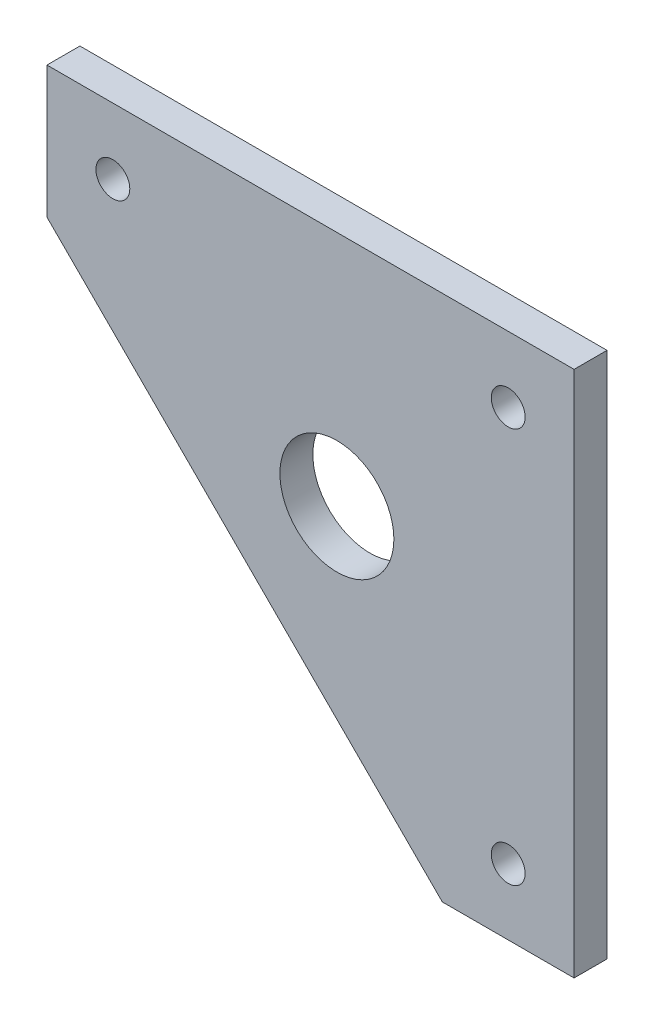
ISO-10303-21;
HEADER;
FILE_DESCRIPTION(('STEP AP214'),'2;1');
FILE_NAME('part.step','',(''),(''),'','','');
FILE_SCHEMA(('AUTOMOTIVE_DESIGN { 1 0 10303 214 1 1 1 1 }'));
ENDSEC;
DATA;
#1=APPLICATION_CONTEXT('core data for automotive mechanical design processes');
#2=APPLICATION_PROTOCOL_DEFINITION('international standard','automotive_design',2000,#1);
#3=PRODUCT_CONTEXT('',#1,'mechanical');
#4=PRODUCT('Part','Part','',(#3));
#5=PRODUCT_RELATED_PRODUCT_CATEGORY('part','',(#4));
#6=PRODUCT_DEFINITION_FORMATION('','',#4);
#7=PRODUCT_DEFINITION_CONTEXT('part definition',#1,'design');
#8=PRODUCT_DEFINITION('design','',#6,#7);
#9=PRODUCT_DEFINITION_SHAPE('','',#8);
#10=(LENGTH_UNIT() NAMED_UNIT(*) SI_UNIT(.MILLI.,.METRE.));
#11=(NAMED_UNIT(*) PLANE_ANGLE_UNIT() SI_UNIT($,.RADIAN.));
#12=(NAMED_UNIT(*) SI_UNIT($,.STERADIAN.) SOLID_ANGLE_UNIT());
#13=UNCERTAINTY_MEASURE_WITH_UNIT(LENGTH_MEASURE(1.E-05),#10,'distance_accuracy_value','');
#14=(GEOMETRIC_REPRESENTATION_CONTEXT(3) GLOBAL_UNCERTAINTY_ASSIGNED_CONTEXT((#13)) GLOBAL_UNIT_ASSIGNED_CONTEXT((#10,
#11,#12)) REPRESENTATION_CONTEXT('',''));
#15=CARTESIAN_POINT('',(0.,0.,0.));
#16=DIRECTION('',(0.,0.,1.));
#17=DIRECTION('',(1.,0.,0.));
#18=AXIS2_PLACEMENT_3D('',#15,#16,#17);
#19=CARTESIAN_POINT('',(0.,0.,6.35));
#20=DIRECTION('',(0.,0.,1.));
#21=DIRECTION('',(1.,0.,0.));
#22=AXIS2_PLACEMENT_3D('',#19,#20,#21);
#23=PLANE('',#22);
#24=CARTESIAN_POINT('',(0.,0.,6.35));
#25=DIRECTION('',(0.,0.,1.));
#26=DIRECTION('',(1.,0.,0.));
#27=AXIS2_PLACEMENT_3D('',#24,#25,#26);
#28=CIRCLE('',#27,3.26389999999999);
#29=CARTESIAN_POINT('',(3.26389999999999,0.,6.35));
#30=VERTEX_POINT('',#29);
#31=EDGE_CURVE('E166',#30,#30,#28,.T.);
#32=ORIENTED_EDGE('',*,*,#31,.F.);
#33=EDGE_LOOP('',(#32));
#34=FACE_BOUND('',#33,.T.);
#35=CARTESIAN_POINT('',(-76.2,0.,6.35));
#36=DIRECTION('',(0.,0.,1.));
#37=DIRECTION('',(1.,0.,0.));
#38=AXIS2_PLACEMENT_3D('',#35,#36,#37);
#39=CIRCLE('',#38,3.26389999999999);
#40=CARTESIAN_POINT('',(-72.9361,0.,6.35));
#41=VERTEX_POINT('',#40);
#42=EDGE_CURVE('E168',#41,#41,#39,.T.);
#43=ORIENTED_EDGE('',*,*,#42,.F.);
#44=EDGE_LOOP('',(#43));
#45=FACE_BOUND('',#44,.T.);
#46=CARTESIAN_POINT('',(0.,-76.2,6.35));
#47=DIRECTION('',(0.,0.,1.));
#48=DIRECTION('',(1.,0.,0.));
#49=AXIS2_PLACEMENT_3D('',#46,#47,#48);
#50=CIRCLE('',#49,3.26389999999999);
#51=CARTESIAN_POINT('',(3.26389999999999,-76.2,6.35));
#52=VERTEX_POINT('',#51);
#53=EDGE_CURVE('E176',#52,#52,#50,.T.);
#54=ORIENTED_EDGE('',*,*,#53,.F.);
#55=EDGE_LOOP('',(#54));
#56=FACE_BOUND('',#55,.T.);
#57=DIRECTION('',(0.,1.,0.));
#58=VECTOR('',#57,1.);
#59=CARTESIAN_POINT('',(12.7,12.7,6.35));
#60=LINE('',#59,#58);
#61=CARTESIAN_POINT('',(12.7,-88.9,6.35));
#62=VERTEX_POINT('',#61);
#63=CARTESIAN_POINT('',(12.7,12.7,6.35));
#64=VERTEX_POINT('',#63);
#65=EDGE_CURVE('E117',#62,#64,#60,.T.);
#66=ORIENTED_EDGE('',*,*,#65,.T.);
#67=DIRECTION('',(-1.,0.,0.));
#68=VECTOR('',#67,1.);
#69=CARTESIAN_POINT('',(-88.9,12.7,6.35));
#70=LINE('',#69,#68);
#71=CARTESIAN_POINT('',(-88.9,12.7,6.35));
#72=VERTEX_POINT('',#71);
#73=EDGE_CURVE('E84',#64,#72,#70,.T.);
#74=ORIENTED_EDGE('',*,*,#73,.T.);
#75=DIRECTION('',(0.,-1.,0.));
#76=VECTOR('',#75,1.);
#77=CARTESIAN_POINT('',(-88.9,12.7,6.35));
#78=LINE('',#77,#76);
#79=CARTESIAN_POINT('',(-88.9,-12.7,6.35));
#80=VERTEX_POINT('',#79);
#81=EDGE_CURVE('E88',#72,#80,#78,.T.);
#82=ORIENTED_EDGE('',*,*,#81,.T.);
#83=DIRECTION('',(0.707106781186547,-0.707106781186547,0.));
#84=VECTOR('',#83,1.);
#85=CARTESIAN_POINT('',(-88.9,-12.7,6.35));
#86=LINE('',#85,#84);
#87=CARTESIAN_POINT('',(-12.7,-88.9,6.35));
#88=VERTEX_POINT('',#87);
#89=EDGE_CURVE('E92',#80,#88,#86,.T.);
#90=ORIENTED_EDGE('',*,*,#89,.T.);
#91=DIRECTION('',(1.,0.,0.));
#92=VECTOR('',#91,1.);
#93=CARTESIAN_POINT('',(-12.7,-88.9,6.35));
#94=LINE('',#93,#92);
#95=EDGE_CURVE('E50',#88,#62,#94,.T.);
#96=ORIENTED_EDGE('',*,*,#95,.T.);
#97=EDGE_LOOP('',(#66,#74,#82,#90,#96));
#98=FACE_BOUND('',#97,.T.);
#99=CARTESIAN_POINT('',(-33.02,-33.02,6.35));
#100=DIRECTION('',(0.,0.,1.));
#101=DIRECTION('',(1.,0.,0.));
#102=AXIS2_PLACEMENT_3D('',#99,#100,#101);
#103=CIRCLE('',#102,10.9855);
#104=CARTESIAN_POINT('',(-22.0345,-33.02,6.35));
#105=VERTEX_POINT('',#104);
#106=EDGE_CURVE('E112',#105,#105,#103,.T.);
#107=ORIENTED_EDGE('',*,*,#106,.F.);
#108=EDGE_LOOP('',(#107));
#109=FACE_BOUND('',#108,.T.);
#110=ADVANCED_FACE('F33',(#34,#45,#56,#98,#109),#23,.T.);
#111=CARTESIAN_POINT('',(0.,0.,0.));
#112=DIRECTION('',(0.,0.,1.));
#113=DIRECTION('',(1.,0.,0.));
#114=AXIS2_PLACEMENT_3D('',#111,#112,#113);
#115=PLANE('',#114);
#116=CARTESIAN_POINT('',(0.,0.,0.));
#117=DIRECTION('',(0.,0.,1.));
#118=DIRECTION('',(1.,0.,0.));
#119=AXIS2_PLACEMENT_3D('',#116,#117,#118);
#120=CIRCLE('',#119,3.2639);
#121=CARTESIAN_POINT('',(3.2639,0.,0.));
#122=VERTEX_POINT('',#121);
#123=EDGE_CURVE('E164',#122,#122,#120,.T.);
#124=ORIENTED_EDGE('',*,*,#123,.T.);
#125=EDGE_LOOP('',(#124));
#126=FACE_BOUND('',#125,.T.);
#127=CARTESIAN_POINT('',(-76.2,0.,0.));
#128=DIRECTION('',(0.,0.,1.));
#129=DIRECTION('',(1.,0.,0.));
#130=AXIS2_PLACEMENT_3D('',#127,#128,#129);
#131=CIRCLE('',#130,3.2639);
#132=CARTESIAN_POINT('',(-72.9361,0.,0.));
#133=VERTEX_POINT('',#132);
#134=EDGE_CURVE('E173',#133,#133,#131,.T.);
#135=ORIENTED_EDGE('',*,*,#134,.T.);
#136=EDGE_LOOP('',(#135));
#137=FACE_BOUND('',#136,.T.);
#138=CARTESIAN_POINT('',(0.,-76.2,0.));
#139=DIRECTION('',(0.,0.,1.));
#140=DIRECTION('',(1.,0.,0.));
#141=AXIS2_PLACEMENT_3D('',#138,#139,#140);
#142=CIRCLE('',#141,3.2639);
#143=CARTESIAN_POINT('',(3.2639,-76.2,0.));
#144=VERTEX_POINT('',#143);
#145=EDGE_CURVE('E179',#144,#144,#142,.T.);
#146=ORIENTED_EDGE('',*,*,#145,.T.);
#147=EDGE_LOOP('',(#146));
#148=FACE_BOUND('',#147,.T.);
#149=DIRECTION('',(0.,1.,0.));
#150=VECTOR('',#149,1.);
#151=CARTESIAN_POINT('',(12.7,12.7,0.));
#152=LINE('',#151,#150);
#153=CARTESIAN_POINT('',(12.7,-88.9,0.));
#154=VERTEX_POINT('',#153);
#155=CARTESIAN_POINT('',(12.7,12.7,0.));
#156=VERTEX_POINT('',#155);
#157=EDGE_CURVE('E108',#154,#156,#152,.T.);
#158=ORIENTED_EDGE('',*,*,#157,.F.);
#159=DIRECTION('',(1.,0.,0.));
#160=VECTOR('',#159,1.);
#161=CARTESIAN_POINT('',(-12.7,-88.9,0.));
#162=LINE('',#161,#160);
#163=CARTESIAN_POINT('',(-12.7,-88.9,0.));
#164=VERTEX_POINT('',#163);
#165=EDGE_CURVE('E76',#164,#154,#162,.T.);
#166=ORIENTED_EDGE('',*,*,#165,.F.);
#167=DIRECTION('',(0.707106781186547,-0.707106781186547,0.));
#168=VECTOR('',#167,1.);
#169=CARTESIAN_POINT('',(-88.9,-12.7,0.));
#170=LINE('',#169,#168);
#171=CARTESIAN_POINT('',(-88.9,-12.7,0.));
#172=VERTEX_POINT('',#171);
#173=EDGE_CURVE('E70',#172,#164,#170,.T.);
#174=ORIENTED_EDGE('',*,*,#173,.F.);
#175=DIRECTION('',(0.,-1.,0.));
#176=VECTOR('',#175,1.);
#177=CARTESIAN_POINT('',(-88.9,12.7,0.));
#178=LINE('',#177,#176);
#179=CARTESIAN_POINT('',(-88.9,12.7,0.));
#180=VERTEX_POINT('',#179);
#181=EDGE_CURVE('E99',#180,#172,#178,.T.);
#182=ORIENTED_EDGE('',*,*,#181,.F.);
#183=DIRECTION('',(-1.,0.,0.));
#184=VECTOR('',#183,1.);
#185=CARTESIAN_POINT('',(-88.9,12.7,0.));
#186=LINE('',#185,#184);
#187=EDGE_CURVE('E111',#156,#180,#186,.T.);
#188=ORIENTED_EDGE('',*,*,#187,.F.);
#189=EDGE_LOOP('',(#158,#166,#174,#182,#188));
#190=FACE_BOUND('',#189,.T.);
#191=CARTESIAN_POINT('',(-33.02,-33.02,0.));
#192=DIRECTION('',(0.,0.,1.));
#193=DIRECTION('',(1.,0.,0.));
#194=AXIS2_PLACEMENT_3D('',#191,#192,#193);
#195=CIRCLE('',#194,10.9855);
#196=CARTESIAN_POINT('',(-22.0345,-33.02,0.));
#197=VERTEX_POINT('',#196);
#198=EDGE_CURVE('E182',#197,#197,#195,.T.);
#199=ORIENTED_EDGE('',*,*,#198,.T.);
#200=EDGE_LOOP('',(#199));
#201=FACE_BOUND('',#200,.T.);
#202=ADVANCED_FACE('F121',(#126,#137,#148,#190,#201),#115,.F.);
#203=CARTESIAN_POINT('',(12.7,12.7,6.35));
#204=DIRECTION('',(-1.,0.,0.));
#205=DIRECTION('',(0.,-1.,0.));
#206=AXIS2_PLACEMENT_3D('',#203,#204,#205);
#207=PLANE('',#206);
#208=ORIENTED_EDGE('',*,*,#157,.T.);
#209=DIRECTION('',(0.,0.,-1.));
#210=VECTOR('',#209,1.);
#211=CARTESIAN_POINT('',(12.7,12.7,6.35));
#212=LINE('',#211,#210);
#213=EDGE_CURVE('E11',#64,#156,#212,.T.);
#214=ORIENTED_EDGE('',*,*,#213,.F.);
#215=ORIENTED_EDGE('',*,*,#65,.F.);
#216=DIRECTION('',(0.,0.,-1.));
#217=VECTOR('',#216,1.);
#218=CARTESIAN_POINT('',(12.7,-88.9,6.35));
#219=LINE('',#218,#217);
#220=EDGE_CURVE('E104',#62,#154,#219,.T.);
#221=ORIENTED_EDGE('',*,*,#220,.T.);
#222=EDGE_LOOP('',(#208,#214,#215,#221));
#223=FACE_BOUND('',#222,.T.);
#224=ADVANCED_FACE('F35',(#223),#207,.F.);
#225=CARTESIAN_POINT('',(-88.9,12.7,6.35));
#226=DIRECTION('',(0.,-1.,0.));
#227=DIRECTION('',(1.,0.,0.));
#228=AXIS2_PLACEMENT_3D('',#225,#226,#227);
#229=PLANE('',#228);
#230=ORIENTED_EDGE('',*,*,#187,.T.);
#231=DIRECTION('',(0.,0.,-1.));
#232=VECTOR('',#231,1.);
#233=CARTESIAN_POINT('',(-88.9,12.7,6.35));
#234=LINE('',#233,#232);
#235=EDGE_CURVE('E42',#72,#180,#234,.T.);
#236=ORIENTED_EDGE('',*,*,#235,.F.);
#237=ORIENTED_EDGE('',*,*,#73,.F.);
#238=ORIENTED_EDGE('',*,*,#213,.T.);
#239=EDGE_LOOP('',(#230,#236,#237,#238));
#240=FACE_BOUND('',#239,.T.);
#241=ADVANCED_FACE('F233',(#240),#229,.F.);
#242=CARTESIAN_POINT('',(-88.9,12.7,6.35));
#243=DIRECTION('',(1.,0.,0.));
#244=DIRECTION('',(0.,0.,-1.));
#245=AXIS2_PLACEMENT_3D('',#242,#243,#244);
#246=PLANE('',#245);
#247=ORIENTED_EDGE('',*,*,#181,.T.);
#248=DIRECTION('',(0.,0.,-1.));
#249=VECTOR('',#248,1.);
#250=CARTESIAN_POINT('',(-88.9,-12.7,6.35));
#251=LINE('',#250,#249);
#252=EDGE_CURVE('E96',#80,#172,#251,.T.);
#253=ORIENTED_EDGE('',*,*,#252,.F.);
#254=ORIENTED_EDGE('',*,*,#81,.F.);
#255=ORIENTED_EDGE('',*,*,#235,.T.);
#256=EDGE_LOOP('',(#247,#253,#254,#255));
#257=FACE_BOUND('',#256,.T.);
#258=ADVANCED_FACE('F97',(#257),#246,.F.);
#259=CARTESIAN_POINT('',(-88.9,-12.7,6.35));
#260=DIRECTION('',(0.707106781186548,0.707106781186548,0.));
#261=DIRECTION('',(-0.707106781186548,0.707106781186547,0.));
#262=AXIS2_PLACEMENT_3D('',#259,#260,#261);
#263=PLANE('',#262);
#264=ORIENTED_EDGE('',*,*,#173,.T.);
#265=DIRECTION('',(0.,0.,-1.));
#266=VECTOR('',#265,1.);
#267=CARTESIAN_POINT('',(-12.7,-88.9,6.35));
#268=LINE('',#267,#266);
#269=EDGE_CURVE('E100',#88,#164,#268,.T.);
#270=ORIENTED_EDGE('',*,*,#269,.F.);
#271=ORIENTED_EDGE('',*,*,#89,.F.);
#272=ORIENTED_EDGE('',*,*,#252,.T.);
#273=EDGE_LOOP('',(#264,#270,#271,#272));
#274=FACE_BOUND('',#273,.T.);
#275=ADVANCED_FACE('F102',(#274),#263,.F.);
#276=CARTESIAN_POINT('',(-12.7,-88.9,6.35));
#277=DIRECTION('',(0.,1.,0.));
#278=DIRECTION('',(0.,0.,1.));
#279=AXIS2_PLACEMENT_3D('',#276,#277,#278);
#280=PLANE('',#279);
#281=ORIENTED_EDGE('',*,*,#165,.T.);
#282=ORIENTED_EDGE('',*,*,#220,.F.);
#283=ORIENTED_EDGE('',*,*,#95,.F.);
#284=ORIENTED_EDGE('',*,*,#269,.T.);
#285=EDGE_LOOP('',(#281,#282,#283,#284));
#286=FACE_BOUND('',#285,.T.);
#287=ADVANCED_FACE('F126',(#286),#280,.F.);
#288=CARTESIAN_POINT('',(-33.02,-33.02,6.35));
#289=DIRECTION('',(0.,0.,-1.));
#290=DIRECTION('',(-1.,0.,0.));
#291=AXIS2_PLACEMENT_3D('',#288,#289,#290);
#292=CYLINDRICAL_SURFACE('',#291,10.9855);
#293=ORIENTED_EDGE('',*,*,#106,.T.);
#294=EDGE_LOOP('',(#293));
#295=FACE_BOUND('',#294,.T.);
#296=ORIENTED_EDGE('',*,*,#198,.F.);
#297=EDGE_LOOP('',(#296));
#298=FACE_BOUND('',#297,.T.);
#299=ADVANCED_FACE('F128',(#295,#298),#292,.F.);
#300=CARTESIAN_POINT('',(0.,-76.2,6.35));
#301=DIRECTION('',(0.,0.,1.));
#302=DIRECTION('',(1.,0.,0.));
#303=AXIS2_PLACEMENT_3D('',#300,#301,#302);
#304=CYLINDRICAL_SURFACE('',#303,3.26389999999999);
#305=ORIENTED_EDGE('',*,*,#145,.F.);
#306=EDGE_LOOP('',(#305));
#307=FACE_BOUND('',#306,.T.);
#308=ORIENTED_EDGE('',*,*,#53,.T.);
#309=EDGE_LOOP('',(#308));
#310=FACE_BOUND('',#309,.T.);
#311=ADVANCED_FACE('F134',(#307,#310),#304,.F.);
#312=CARTESIAN_POINT('',(-76.2,0.,6.35));
#313=DIRECTION('',(0.,0.,1.));
#314=DIRECTION('',(1.,0.,0.));
#315=AXIS2_PLACEMENT_3D('',#312,#313,#314);
#316=CYLINDRICAL_SURFACE('',#315,3.26389999999999);
#317=ORIENTED_EDGE('',*,*,#134,.F.);
#318=EDGE_LOOP('',(#317));
#319=FACE_BOUND('',#318,.T.);
#320=ORIENTED_EDGE('',*,*,#42,.T.);
#321=EDGE_LOOP('',(#320));
#322=FACE_BOUND('',#321,.T.);
#323=ADVANCED_FACE('F151',(#319,#322),#316,.F.);
#324=CARTESIAN_POINT('',(0.,0.,6.35));
#325=DIRECTION('',(0.,0.,1.));
#326=DIRECTION('',(1.,0.,0.));
#327=AXIS2_PLACEMENT_3D('',#324,#325,#326);
#328=CYLINDRICAL_SURFACE('',#327,3.26389999999999);
#329=ORIENTED_EDGE('',*,*,#123,.F.);
#330=EDGE_LOOP('',(#329));
#331=FACE_BOUND('',#330,.T.);
#332=ORIENTED_EDGE('',*,*,#31,.T.);
#333=EDGE_LOOP('',(#332));
#334=FACE_BOUND('',#333,.T.);
#335=ADVANCED_FACE('F155',(#331,#334),#328,.F.);
#336=CLOSED_SHELL('',(#110,#202,#224,#241,#258,#275,#287,#299,#311,#323,#335));
#337=MANIFOLD_SOLID_BREP('B2',#336);
#338=ADVANCED_BREP_SHAPE_REPRESENTATION('',(#18,#337),#14);
#339=SHAPE_DEFINITION_REPRESENTATION(#9,#338);
ENDSEC;
END-ISO-10303-21;
